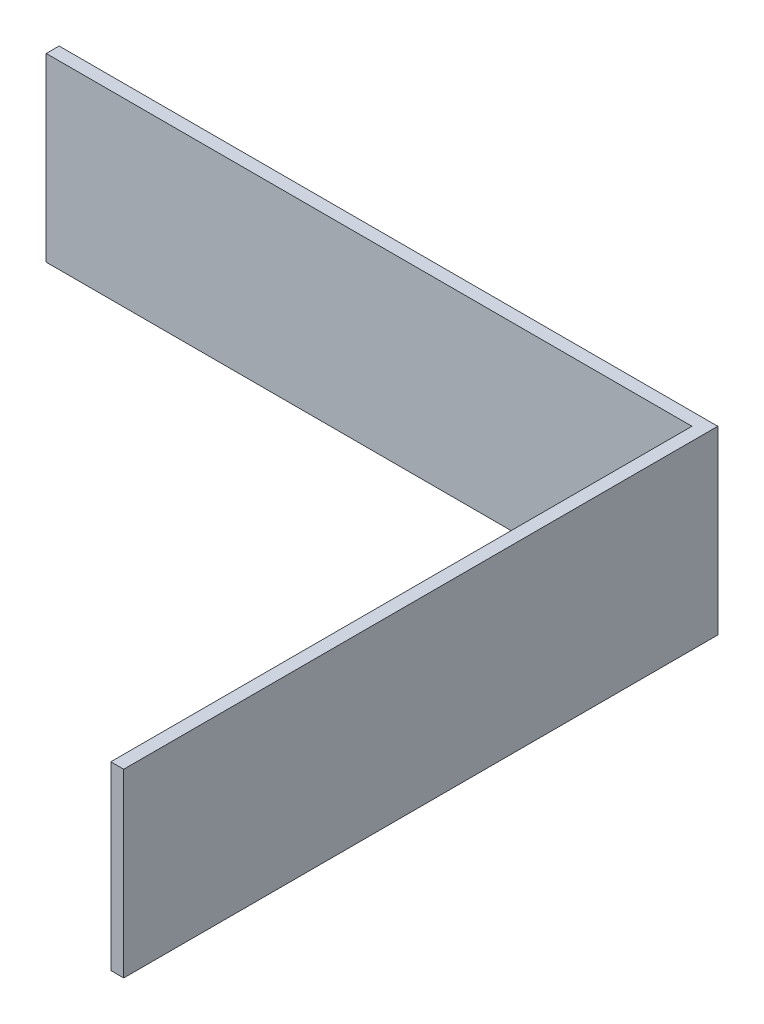
ISO-10303-21;
HEADER;
FILE_DESCRIPTION(('STEP AP214'),'2;1');
FILE_NAME('part.step','',(''),(''),'','','');
FILE_SCHEMA(('AUTOMOTIVE_DESIGN { 1 0 10303 214 1 1 1 1 }'));
ENDSEC;
DATA;
#1=APPLICATION_CONTEXT('core data for automotive mechanical design processes');
#2=APPLICATION_PROTOCOL_DEFINITION('international standard','automotive_design',2000,#1);
#3=PRODUCT_CONTEXT('',#1,'mechanical');
#4=PRODUCT('Part','Part','',(#3));
#5=PRODUCT_RELATED_PRODUCT_CATEGORY('part','',(#4));
#6=PRODUCT_DEFINITION_FORMATION('','',#4);
#7=PRODUCT_DEFINITION_CONTEXT('part definition',#1,'design');
#8=PRODUCT_DEFINITION('design','',#6,#7);
#9=PRODUCT_DEFINITION_SHAPE('','',#8);
#10=(LENGTH_UNIT() NAMED_UNIT(*) SI_UNIT(.MILLI.,.METRE.));
#11=(NAMED_UNIT(*) PLANE_ANGLE_UNIT() SI_UNIT($,.RADIAN.));
#12=(NAMED_UNIT(*) SI_UNIT($,.STERADIAN.) SOLID_ANGLE_UNIT());
#13=UNCERTAINTY_MEASURE_WITH_UNIT(LENGTH_MEASURE(1.E-05),#10,'distance_accuracy_value','');
#14=(GEOMETRIC_REPRESENTATION_CONTEXT(3) GLOBAL_UNCERTAINTY_ASSIGNED_CONTEXT((#13)) GLOBAL_UNIT_ASSIGNED_CONTEXT((#10,
#11,#12)) REPRESENTATION_CONTEXT('',''));
#15=CARTESIAN_POINT('',(0.,0.,0.));
#16=DIRECTION('',(0.,0.,1.));
#17=DIRECTION('',(1.,0.,0.));
#18=AXIS2_PLACEMENT_3D('',#15,#16,#17);
#19=CARTESIAN_POINT('',(0.,140.,450.));
#20=DIRECTION('',(1.,0.,0.));
#21=DIRECTION('',(0.,0.,-1.));
#22=AXIS2_PLACEMENT_3D('',#19,#20,#21);
#23=PLANE('',#22);
#24=DIRECTION('',(0.,0.,1.));
#25=VECTOR('',#24,1.);
#26=CARTESIAN_POINT('',(0.,0.,450.));
#27=LINE('',#26,#25);
#28=CARTESIAN_POINT('',(0.,0.,0.));
#29=VERTEX_POINT('',#28);
#30=CARTESIAN_POINT('',(0.,0.,450.));
#31=VERTEX_POINT('',#30);
#32=EDGE_CURVE('E117',#29,#31,#27,.T.);
#33=ORIENTED_EDGE('',*,*,#32,.T.);
#34=DIRECTION('',(0.,-1.,0.));
#35=VECTOR('',#34,1.);
#36=CARTESIAN_POINT('',(0.,140.,450.));
#37=LINE('',#36,#35);
#38=CARTESIAN_POINT('',(0.,140.,450.));
#39=VERTEX_POINT('',#38);
#40=EDGE_CURVE('E11',#39,#31,#37,.T.);
#41=ORIENTED_EDGE('',*,*,#40,.F.);
#42=DIRECTION('',(0.,0.,1.));
#43=VECTOR('',#42,1.);
#44=CARTESIAN_POINT('',(0.,140.,450.));
#45=LINE('',#44,#43);
#46=CARTESIAN_POINT('',(0.,140.,0.));
#47=VERTEX_POINT('',#46);
#48=EDGE_CURVE('E127',#47,#39,#45,.T.);
#49=ORIENTED_EDGE('',*,*,#48,.F.);
#50=DIRECTION('',(0.,-1.,0.));
#51=VECTOR('',#50,1.);
#52=CARTESIAN_POINT('',(0.,140.,0.));
#53=LINE('',#52,#51);
#54=EDGE_CURVE('E113',#47,#29,#53,.T.);
#55=ORIENTED_EDGE('',*,*,#54,.T.);
#56=EDGE_LOOP('',(#33,#41,#49,#55));
#57=FACE_BOUND('',#56,.T.);
#58=ADVANCED_FACE('F33',(#57),#23,.F.);
#59=CARTESIAN_POINT('',(10.,140.,450.));
#60=DIRECTION('',(0.,0.,-1.));
#61=DIRECTION('',(-1.,0.,0.));
#62=AXIS2_PLACEMENT_3D('',#59,#60,#61);
#63=PLANE('',#62);
#64=DIRECTION('',(1.,0.,0.));
#65=VECTOR('',#64,1.);
#66=CARTESIAN_POINT('',(10.,0.,450.));
#67=LINE('',#66,#65);
#68=CARTESIAN_POINT('',(10.,0.,450.));
#69=VERTEX_POINT('',#68);
#70=EDGE_CURVE('E120',#31,#69,#67,.T.);
#71=ORIENTED_EDGE('',*,*,#70,.T.);
#72=DIRECTION('',(0.,-1.,0.));
#73=VECTOR('',#72,1.);
#74=CARTESIAN_POINT('',(10.,140.,450.));
#75=LINE('',#74,#73);
#76=CARTESIAN_POINT('',(10.,140.,450.));
#77=VERTEX_POINT('',#76);
#78=EDGE_CURVE('E41',#77,#69,#75,.T.);
#79=ORIENTED_EDGE('',*,*,#78,.F.);
#80=DIRECTION('',(1.,0.,0.));
#81=VECTOR('',#80,1.);
#82=CARTESIAN_POINT('',(10.,140.,450.));
#83=LINE('',#82,#81);
#84=EDGE_CURVE('E86',#39,#77,#83,.T.);
#85=ORIENTED_EDGE('',*,*,#84,.F.);
#86=ORIENTED_EDGE('',*,*,#40,.T.);
#87=EDGE_LOOP('',(#71,#79,#85,#86));
#88=FACE_BOUND('',#87,.T.);
#89=ADVANCED_FACE('F151',(#88),#63,.F.);
#90=CARTESIAN_POINT('',(9.9999999999999,140.,-9.99999999999994));
#91=DIRECTION('',(-1.,0.,0.));
#92=DIRECTION('',(0.,0.,1.));
#93=AXIS2_PLACEMENT_3D('',#90,#91,#92);
#94=PLANE('',#93);
#95=DIRECTION('',(0.,0.,-1.));
#96=VECTOR('',#95,1.);
#97=CARTESIAN_POINT('',(9.9999999999999,0.,-9.99999999999994));
#98=LINE('',#97,#96);
#99=CARTESIAN_POINT('',(9.9999999999999,0.,-9.99999999999994));
#100=VERTEX_POINT('',#99);
#101=EDGE_CURVE('E122',#69,#100,#98,.T.);
#102=ORIENTED_EDGE('',*,*,#101,.T.);
#103=DIRECTION('',(0.,-1.,0.));
#104=VECTOR('',#103,1.);
#105=CARTESIAN_POINT('',(9.9999999999999,140.,-9.99999999999994));
#106=LINE('',#105,#104);
#107=CARTESIAN_POINT('',(9.9999999999999,140.,-9.99999999999994));
#108=VERTEX_POINT('',#107);
#109=EDGE_CURVE('E108',#108,#100,#106,.T.);
#110=ORIENTED_EDGE('',*,*,#109,.F.);
#111=DIRECTION('',(0.,0.,-1.));
#112=VECTOR('',#111,1.);
#113=CARTESIAN_POINT('',(9.9999999999999,140.,-9.99999999999994));
#114=LINE('',#113,#112);
#115=EDGE_CURVE('E99',#77,#108,#114,.T.);
#116=ORIENTED_EDGE('',*,*,#115,.F.);
#117=ORIENTED_EDGE('',*,*,#78,.T.);
#118=EDGE_LOOP('',(#102,#110,#116,#117));
#119=FACE_BOUND('',#118,.T.);
#120=ADVANCED_FACE('F133',(#119),#94,.F.);
#121=CARTESIAN_POINT('',(-500.,140.,-9.99999999999994));
#122=DIRECTION('',(0.,0.,1.));
#123=DIRECTION('',(1.,0.,0.));
#124=AXIS2_PLACEMENT_3D('',#121,#122,#123);
#125=PLANE('',#124);
#126=DIRECTION('',(-1.,0.,0.));
#127=VECTOR('',#126,1.);
#128=CARTESIAN_POINT('',(-500.,0.,-9.99999999999994));
#129=LINE('',#128,#127);
#130=CARTESIAN_POINT('',(-500.,0.,-9.99999999999994));
#131=VERTEX_POINT('',#130);
#132=EDGE_CURVE('E107',#100,#131,#129,.T.);
#133=ORIENTED_EDGE('',*,*,#132,.T.);
#134=DIRECTION('',(0.,-1.,0.));
#135=VECTOR('',#134,1.);
#136=CARTESIAN_POINT('',(-500.,140.,-9.99999999999994));
#137=LINE('',#136,#135);
#138=CARTESIAN_POINT('',(-500.,140.,-9.99999999999994));
#139=VERTEX_POINT('',#138);
#140=EDGE_CURVE('E104',#139,#131,#137,.T.);
#141=ORIENTED_EDGE('',*,*,#140,.F.);
#142=DIRECTION('',(-1.,0.,0.));
#143=VECTOR('',#142,1.);
#144=CARTESIAN_POINT('',(-500.,140.,-9.99999999999994));
#145=LINE('',#144,#143);
#146=EDGE_CURVE('E93',#108,#139,#145,.T.);
#147=ORIENTED_EDGE('',*,*,#146,.F.);
#148=ORIENTED_EDGE('',*,*,#109,.T.);
#149=EDGE_LOOP('',(#133,#141,#147,#148));
#150=FACE_BOUND('',#149,.T.);
#151=ADVANCED_FACE('F105',(#150),#125,.F.);
#152=CARTESIAN_POINT('',(-500.,140.,0.));
#153=DIRECTION('',(1.,0.,0.));
#154=DIRECTION('',(0.,0.,-1.));
#155=AXIS2_PLACEMENT_3D('',#152,#153,#154);
#156=PLANE('',#155);
#157=DIRECTION('',(0.,0.,1.));
#158=VECTOR('',#157,1.);
#159=CARTESIAN_POINT('',(-500.,0.,0.));
#160=LINE('',#159,#158);
#161=CARTESIAN_POINT('',(-500.,0.,0.));
#162=VERTEX_POINT('',#161);
#163=EDGE_CURVE('E72',#131,#162,#160,.T.);
#164=ORIENTED_EDGE('',*,*,#163,.T.);
#165=DIRECTION('',(0.,-1.,0.));
#166=VECTOR('',#165,1.);
#167=CARTESIAN_POINT('',(-500.,140.,0.));
#168=LINE('',#167,#166);
#169=CARTESIAN_POINT('',(-500.,140.,0.));
#170=VERTEX_POINT('',#169);
#171=EDGE_CURVE('E109',#170,#162,#168,.T.);
#172=ORIENTED_EDGE('',*,*,#171,.F.);
#173=DIRECTION('',(0.,0.,1.));
#174=VECTOR('',#173,1.);
#175=CARTESIAN_POINT('',(-500.,140.,0.));
#176=LINE('',#175,#174);
#177=EDGE_CURVE('E97',#139,#170,#176,.T.);
#178=ORIENTED_EDGE('',*,*,#177,.F.);
#179=ORIENTED_EDGE('',*,*,#140,.T.);
#180=EDGE_LOOP('',(#164,#172,#178,#179));
#181=FACE_BOUND('',#180,.T.);
#182=ADVANCED_FACE('F111',(#181),#156,.F.);
#183=CARTESIAN_POINT('',(0.,140.,0.));
#184=DIRECTION('',(0.,0.,-1.));
#185=DIRECTION('',(-1.,0.,0.));
#186=AXIS2_PLACEMENT_3D('',#183,#184,#185);
#187=PLANE('',#186);
#188=DIRECTION('',(1.,0.,0.));
#189=VECTOR('',#188,1.);
#190=CARTESIAN_POINT('',(0.,0.,0.));
#191=LINE('',#190,#189);
#192=EDGE_CURVE('E78',#162,#29,#191,.T.);
#193=ORIENTED_EDGE('',*,*,#192,.T.);
#194=ORIENTED_EDGE('',*,*,#54,.F.);
#195=DIRECTION('',(1.,0.,0.));
#196=VECTOR('',#195,1.);
#197=CARTESIAN_POINT('',(0.,140.,0.));
#198=LINE('',#197,#196);
#199=EDGE_CURVE('E49',#170,#47,#198,.T.);
#200=ORIENTED_EDGE('',*,*,#199,.F.);
#201=ORIENTED_EDGE('',*,*,#171,.T.);
#202=EDGE_LOOP('',(#193,#194,#200,#201));
#203=FACE_BOUND('',#202,.T.);
#204=ADVANCED_FACE('F140',(#203),#187,.F.);
#205=CARTESIAN_POINT('',(0.,140.,0.));
#206=DIRECTION('',(0.,1.,0.));
#207=DIRECTION('',(0.,0.,1.));
#208=AXIS2_PLACEMENT_3D('',#205,#206,#207);
#209=PLANE('',#208);
#210=ORIENTED_EDGE('',*,*,#48,.T.);
#211=ORIENTED_EDGE('',*,*,#84,.T.);
#212=ORIENTED_EDGE('',*,*,#115,.T.);
#213=ORIENTED_EDGE('',*,*,#146,.T.);
#214=ORIENTED_EDGE('',*,*,#177,.T.);
#215=ORIENTED_EDGE('',*,*,#199,.T.);
#216=EDGE_LOOP('',(#210,#211,#212,#213,#214,#215));
#217=FACE_BOUND('',#216,.T.);
#218=ADVANCED_FACE('F95',(#217),#209,.T.);
#219=CARTESIAN_POINT('',(0.,0.,0.));
#220=DIRECTION('',(0.,1.,0.));
#221=DIRECTION('',(0.,0.,1.));
#222=AXIS2_PLACEMENT_3D('',#219,#220,#221);
#223=PLANE('',#222);
#224=ORIENTED_EDGE('',*,*,#32,.F.);
#225=ORIENTED_EDGE('',*,*,#192,.F.);
#226=ORIENTED_EDGE('',*,*,#163,.F.);
#227=ORIENTED_EDGE('',*,*,#132,.F.);
#228=ORIENTED_EDGE('',*,*,#101,.F.);
#229=ORIENTED_EDGE('',*,*,#70,.F.);
#230=EDGE_LOOP('',(#224,#225,#226,#227,#228,#229));
#231=FACE_BOUND('',#230,.T.);
#232=ADVANCED_FACE('F136',(#231),#223,.F.);
#233=CLOSED_SHELL('',(#58,#89,#120,#151,#182,#204,#218,#232));
#234=MANIFOLD_SOLID_BREP('B2',#233);
#235=ADVANCED_BREP_SHAPE_REPRESENTATION('',(#18,#234),#14);
#236=SHAPE_DEFINITION_REPRESENTATION(#9,#235);
ENDSEC;
END-ISO-10303-21;
